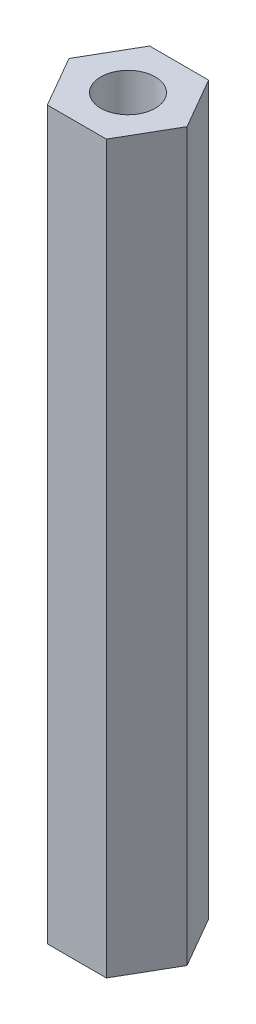
ISO-10303-21;
HEADER;
FILE_DESCRIPTION(('STEP AP214'),'2;1');
FILE_NAME('part.step','',(''),(''),'','','');
FILE_SCHEMA(('AUTOMOTIVE_DESIGN { 1 0 10303 214 1 1 1 1 }'));
ENDSEC;
DATA;
#1=APPLICATION_CONTEXT('core data for automotive mechanical design processes');
#2=APPLICATION_PROTOCOL_DEFINITION('international standard','automotive_design',2000,#1);
#3=PRODUCT_CONTEXT('',#1,'mechanical');
#4=PRODUCT('Part','Part','',(#3));
#5=PRODUCT_RELATED_PRODUCT_CATEGORY('part','',(#4));
#6=PRODUCT_DEFINITION_FORMATION('','',#4);
#7=PRODUCT_DEFINITION_CONTEXT('part definition',#1,'design');
#8=PRODUCT_DEFINITION('design','',#6,#7);
#9=PRODUCT_DEFINITION_SHAPE('','',#8);
#10=(LENGTH_UNIT() NAMED_UNIT(*) SI_UNIT(.MILLI.,.METRE.));
#11=(NAMED_UNIT(*) PLANE_ANGLE_UNIT() SI_UNIT($,.RADIAN.));
#12=(NAMED_UNIT(*) SI_UNIT($,.STERADIAN.) SOLID_ANGLE_UNIT());
#13=UNCERTAINTY_MEASURE_WITH_UNIT(LENGTH_MEASURE(1.E-05),#10,'distance_accuracy_value','');
#14=(GEOMETRIC_REPRESENTATION_CONTEXT(3) GLOBAL_UNCERTAINTY_ASSIGNED_CONTEXT((#13)) GLOBAL_UNIT_ASSIGNED_CONTEXT((#10,
#11,#12)) REPRESENTATION_CONTEXT('',''));
#15=CARTESIAN_POINT('',(0.,0.,0.));
#16=DIRECTION('',(0.,0.,1.));
#17=DIRECTION('',(1.,0.,0.));
#18=AXIS2_PLACEMENT_3D('',#15,#16,#17);
#19=CARTESIAN_POINT('',(0.,40.,0.));
#20=DIRECTION('',(0.,1.,0.));
#21=DIRECTION('',(0.,0.,1.));
#22=AXIS2_PLACEMENT_3D('',#19,#20,#21);
#23=PLANE('',#22);
#24=DIRECTION('',(-1.,0.,0.));
#25=VECTOR('',#24,1.);
#26=CARTESIAN_POINT('',(1.62499999999999,40.,-2.81458256229941));
#27=LINE('',#26,#25);
#28=CARTESIAN_POINT('',(1.62499999999999,40.,-2.81458256229941));
#29=VERTEX_POINT('',#28);
#30=CARTESIAN_POINT('',(-1.62499999999999,40.,-2.81458256229941));
#31=VERTEX_POINT('',#30);
#32=EDGE_CURVE('E135',#29,#31,#27,.T.);
#33=ORIENTED_EDGE('',*,*,#32,.T.);
#34=DIRECTION('',(-0.5,0.,0.866025403784439));
#35=VECTOR('',#34,1.);
#36=CARTESIAN_POINT('',(-1.62499999999999,40.,-2.81458256229941));
#37=LINE('',#36,#35);
#38=CARTESIAN_POINT('',(-3.24999999999998,40.,0.));
#39=VERTEX_POINT('',#38);
#40=EDGE_CURVE('E93',#31,#39,#37,.T.);
#41=ORIENTED_EDGE('',*,*,#40,.T.);
#42=DIRECTION('',(0.5,0.,0.866025403784439));
#43=VECTOR('',#42,1.);
#44=CARTESIAN_POINT('',(-3.24999999999998,40.,0.));
#45=LINE('',#44,#43);
#46=CARTESIAN_POINT('',(-1.62499999999999,40.,2.81458256229941));
#47=VERTEX_POINT('',#46);
#48=EDGE_CURVE('E106',#39,#47,#45,.T.);
#49=ORIENTED_EDGE('',*,*,#48,.T.);
#50=DIRECTION('',(1.,0.,0.));
#51=VECTOR('',#50,1.);
#52=CARTESIAN_POINT('',(-1.62499999999999,40.,2.81458256229941));
#53=LINE('',#52,#51);
#54=CARTESIAN_POINT('',(1.62499999999999,40.,2.81458256229941));
#55=VERTEX_POINT('',#54);
#56=EDGE_CURVE('E100',#47,#55,#53,.T.);
#57=ORIENTED_EDGE('',*,*,#56,.T.);
#58=DIRECTION('',(0.5,0.,-0.866025403784438));
#59=VECTOR('',#58,1.);
#60=CARTESIAN_POINT('',(1.62499999999999,40.,2.81458256229941));
#61=LINE('',#60,#59);
#62=CARTESIAN_POINT('',(3.24999999999999,40.,0.));
#63=VERTEX_POINT('',#62);
#64=EDGE_CURVE('E104',#55,#63,#61,.T.);
#65=ORIENTED_EDGE('',*,*,#64,.T.);
#66=DIRECTION('',(-0.5,0.,-0.866025403784439));
#67=VECTOR('',#66,1.);
#68=CARTESIAN_POINT('',(3.24999999999999,40.,0.));
#69=LINE('',#68,#67);
#70=EDGE_CURVE('E56',#63,#29,#69,.T.);
#71=ORIENTED_EDGE('',*,*,#70,.T.);
#72=EDGE_LOOP('',(#33,#41,#49,#57,#65,#71));
#73=FACE_BOUND('',#72,.T.);
#74=CARTESIAN_POINT('',(0.,40.,0.));
#75=DIRECTION('',(0.,1.,0.));
#76=DIRECTION('',(0.,0.,1.));
#77=AXIS2_PLACEMENT_3D('',#74,#75,#76);
#78=CIRCLE('',#77,1.5);
#79=CARTESIAN_POINT('',(0.,40.,1.5));
#80=VERTEX_POINT('',#79);
#81=EDGE_CURVE('E128',#80,#80,#78,.T.);
#82=ORIENTED_EDGE('',*,*,#81,.F.);
#83=EDGE_LOOP('',(#82));
#84=FACE_BOUND('',#83,.T.);
#85=ADVANCED_FACE('F39',(#73,#84),#23,.T.);
#86=CARTESIAN_POINT('',(0.,0.,0.));
#87=DIRECTION('',(0.,1.,0.));
#88=DIRECTION('',(0.,0.,1.));
#89=AXIS2_PLACEMENT_3D('',#86,#87,#88);
#90=PLANE('',#89);
#91=DIRECTION('',(-1.,0.,0.));
#92=VECTOR('',#91,1.);
#93=CARTESIAN_POINT('',(1.62499999999999,0.,-2.81458256229941));
#94=LINE('',#93,#92);
#95=CARTESIAN_POINT('',(1.62499999999999,0.,-2.81458256229941));
#96=VERTEX_POINT('',#95);
#97=CARTESIAN_POINT('',(-1.62499999999999,0.,-2.81458256229941));
#98=VERTEX_POINT('',#97);
#99=EDGE_CURVE('E124',#96,#98,#94,.T.);
#100=ORIENTED_EDGE('',*,*,#99,.F.);
#101=DIRECTION('',(-0.5,0.,-0.866025403784439));
#102=VECTOR('',#101,1.);
#103=CARTESIAN_POINT('',(3.24999999999999,0.,0.));
#104=LINE('',#103,#102);
#105=CARTESIAN_POINT('',(3.24999999999999,0.,0.));
#106=VERTEX_POINT('',#105);
#107=EDGE_CURVE('E85',#106,#96,#104,.T.);
#108=ORIENTED_EDGE('',*,*,#107,.F.);
#109=DIRECTION('',(0.5,0.,-0.866025403784438));
#110=VECTOR('',#109,1.);
#111=CARTESIAN_POINT('',(1.62499999999999,0.,2.81458256229941));
#112=LINE('',#111,#110);
#113=CARTESIAN_POINT('',(1.62499999999999,0.,2.81458256229941));
#114=VERTEX_POINT('',#113);
#115=EDGE_CURVE('E79',#114,#106,#112,.T.);
#116=ORIENTED_EDGE('',*,*,#115,.F.);
#117=DIRECTION('',(1.,0.,0.));
#118=VECTOR('',#117,1.);
#119=CARTESIAN_POINT('',(-1.62499999999999,0.,2.81458256229941));
#120=LINE('',#119,#118);
#121=CARTESIAN_POINT('',(-1.62499999999999,0.,2.81458256229941));
#122=VERTEX_POINT('',#121);
#123=EDGE_CURVE('E114',#122,#114,#120,.T.);
#124=ORIENTED_EDGE('',*,*,#123,.F.);
#125=DIRECTION('',(0.5,0.,0.866025403784439));
#126=VECTOR('',#125,1.);
#127=CARTESIAN_POINT('',(-3.24999999999998,0.,0.));
#128=LINE('',#127,#126);
#129=CARTESIAN_POINT('',(-3.24999999999998,0.,0.));
#130=VERTEX_POINT('',#129);
#131=EDGE_CURVE('E130',#130,#122,#128,.T.);
#132=ORIENTED_EDGE('',*,*,#131,.F.);
#133=DIRECTION('',(-0.5,0.,0.866025403784439));
#134=VECTOR('',#133,1.);
#135=CARTESIAN_POINT('',(-1.62499999999999,0.,-2.81458256229941));
#136=LINE('',#135,#134);
#137=EDGE_CURVE('E127',#98,#130,#136,.T.);
#138=ORIENTED_EDGE('',*,*,#137,.F.);
#139=EDGE_LOOP('',(#100,#108,#116,#124,#132,#138));
#140=FACE_BOUND('',#139,.T.);
#141=CARTESIAN_POINT('',(0.,0.,0.));
#142=DIRECTION('',(0.,1.,0.));
#143=DIRECTION('',(0.,0.,1.));
#144=AXIS2_PLACEMENT_3D('',#141,#142,#143);
#145=CIRCLE('',#144,1.5);
#146=CARTESIAN_POINT('',(0.,0.,1.5));
#147=VERTEX_POINT('',#146);
#148=EDGE_CURVE('E228',#147,#147,#145,.T.);
#149=ORIENTED_EDGE('',*,*,#148,.T.);
#150=EDGE_LOOP('',(#149));
#151=FACE_BOUND('',#150,.T.);
#152=ADVANCED_FACE('F144',(#140,#151),#90,.F.);
#153=CARTESIAN_POINT('',(1.62499999999999,40.,-2.81458256229941));
#154=DIRECTION('',(0.,0.,1.));
#155=DIRECTION('',(1.,0.,0.));
#156=AXIS2_PLACEMENT_3D('',#153,#154,#155);
#157=PLANE('',#156);
#158=ORIENTED_EDGE('',*,*,#99,.T.);
#159=DIRECTION('',(0.,-1.,0.));
#160=VECTOR('',#159,1.);
#161=CARTESIAN_POINT('',(-1.62499999999999,40.,-2.81458256229941));
#162=LINE('',#161,#160);
#163=EDGE_CURVE('E11',#31,#98,#162,.T.);
#164=ORIENTED_EDGE('',*,*,#163,.F.);
#165=ORIENTED_EDGE('',*,*,#32,.F.);
#166=DIRECTION('',(0.,-1.,0.));
#167=VECTOR('',#166,1.);
#168=CARTESIAN_POINT('',(1.62499999999999,40.,-2.81458256229941));
#169=LINE('',#168,#167);
#170=EDGE_CURVE('E120',#29,#96,#169,.T.);
#171=ORIENTED_EDGE('',*,*,#170,.T.);
#172=EDGE_LOOP('',(#158,#164,#165,#171));
#173=FACE_BOUND('',#172,.T.);
#174=ADVANCED_FACE('F41',(#173),#157,.F.);
#175=CARTESIAN_POINT('',(-1.62499999999999,40.,-2.81458256229941));
#176=DIRECTION('',(0.866025403784439,0.,0.5));
#177=DIRECTION('',(0.5,0.,-0.866025403784439));
#178=AXIS2_PLACEMENT_3D('',#175,#176,#177);
#179=PLANE('',#178);
#180=ORIENTED_EDGE('',*,*,#137,.T.);
#181=DIRECTION('',(0.,-1.,0.));
#182=VECTOR('',#181,1.);
#183=CARTESIAN_POINT('',(-3.24999999999998,40.,0.));
#184=LINE('',#183,#182);
#185=EDGE_CURVE('E48',#39,#130,#184,.T.);
#186=ORIENTED_EDGE('',*,*,#185,.F.);
#187=ORIENTED_EDGE('',*,*,#40,.F.);
#188=ORIENTED_EDGE('',*,*,#163,.T.);
#189=EDGE_LOOP('',(#180,#186,#187,#188));
#190=FACE_BOUND('',#189,.T.);
#191=ADVANCED_FACE('F169',(#190),#179,.F.);
#192=CARTESIAN_POINT('',(-3.24999999999998,40.,0.));
#193=DIRECTION('',(0.866025403784439,0.,-0.5));
#194=DIRECTION('',(-0.5,0.,-0.866025403784439));
#195=AXIS2_PLACEMENT_3D('',#192,#193,#194);
#196=PLANE('',#195);
#197=ORIENTED_EDGE('',*,*,#131,.T.);
#198=DIRECTION('',(0.,-1.,0.));
#199=VECTOR('',#198,1.);
#200=CARTESIAN_POINT('',(-1.62499999999999,40.,2.81458256229941));
#201=LINE('',#200,#199);
#202=EDGE_CURVE('E115',#47,#122,#201,.T.);
#203=ORIENTED_EDGE('',*,*,#202,.F.);
#204=ORIENTED_EDGE('',*,*,#48,.F.);
#205=ORIENTED_EDGE('',*,*,#185,.T.);
#206=EDGE_LOOP('',(#197,#203,#204,#205));
#207=FACE_BOUND('',#206,.T.);
#208=ADVANCED_FACE('F141',(#207),#196,.F.);
#209=CARTESIAN_POINT('',(-1.62499999999999,40.,2.81458256229941));
#210=DIRECTION('',(0.,0.,-1.));
#211=DIRECTION('',(-1.,0.,0.));
#212=AXIS2_PLACEMENT_3D('',#209,#210,#211);
#213=PLANE('',#212);
#214=ORIENTED_EDGE('',*,*,#123,.T.);
#215=DIRECTION('',(0.,-1.,0.));
#216=VECTOR('',#215,1.);
#217=CARTESIAN_POINT('',(1.62499999999999,40.,2.81458256229941));
#218=LINE('',#217,#216);
#219=EDGE_CURVE('E111',#55,#114,#218,.T.);
#220=ORIENTED_EDGE('',*,*,#219,.F.);
#221=ORIENTED_EDGE('',*,*,#56,.F.);
#222=ORIENTED_EDGE('',*,*,#202,.T.);
#223=EDGE_LOOP('',(#214,#220,#221,#222));
#224=FACE_BOUND('',#223,.T.);
#225=ADVANCED_FACE('F112',(#224),#213,.F.);
#226=CARTESIAN_POINT('',(1.62499999999999,40.,2.81458256229941));
#227=DIRECTION('',(-0.866025403784438,0.,-0.5));
#228=DIRECTION('',(-0.5,0.,0.866025403784439));
#229=AXIS2_PLACEMENT_3D('',#226,#227,#228);
#230=PLANE('',#229);
#231=ORIENTED_EDGE('',*,*,#115,.T.);
#232=DIRECTION('',(0.,-1.,0.));
#233=VECTOR('',#232,1.);
#234=CARTESIAN_POINT('',(3.24999999999999,40.,0.));
#235=LINE('',#234,#233);
#236=EDGE_CURVE('E116',#63,#106,#235,.T.);
#237=ORIENTED_EDGE('',*,*,#236,.F.);
#238=ORIENTED_EDGE('',*,*,#64,.F.);
#239=ORIENTED_EDGE('',*,*,#219,.T.);
#240=EDGE_LOOP('',(#231,#237,#238,#239));
#241=FACE_BOUND('',#240,.T.);
#242=ADVANCED_FACE('F118',(#241),#230,.F.);
#243=CARTESIAN_POINT('',(3.24999999999999,40.,0.));
#244=DIRECTION('',(-0.866025403784439,0.,0.5));
#245=DIRECTION('',(0.5,0.,0.866025403784439));
#246=AXIS2_PLACEMENT_3D('',#243,#244,#245);
#247=PLANE('',#246);
#248=ORIENTED_EDGE('',*,*,#107,.T.);
#249=ORIENTED_EDGE('',*,*,#170,.F.);
#250=ORIENTED_EDGE('',*,*,#70,.F.);
#251=ORIENTED_EDGE('',*,*,#236,.T.);
#252=EDGE_LOOP('',(#248,#249,#250,#251));
#253=FACE_BOUND('',#252,.T.);
#254=ADVANCED_FACE('F149',(#253),#247,.F.);
#255=CARTESIAN_POINT('',(0.,40.,0.));
#256=DIRECTION('',(0.,-1.,0.));
#257=DIRECTION('',(0.,0.,-1.));
#258=AXIS2_PLACEMENT_3D('',#255,#256,#257);
#259=CYLINDRICAL_SURFACE('',#258,1.5);
#260=ORIENTED_EDGE('',*,*,#81,.T.);
#261=EDGE_LOOP('',(#260));
#262=FACE_BOUND('',#261,.T.);
#263=ORIENTED_EDGE('',*,*,#148,.F.);
#264=EDGE_LOOP('',(#263));
#265=FACE_BOUND('',#264,.T.);
#266=ADVANCED_FACE('F151',(#262,#265),#259,.F.);
#267=CLOSED_SHELL('',(#85,#152,#174,#191,#208,#225,#242,#254,#266));
#268=MANIFOLD_SOLID_BREP('B2',#267);
#269=ADVANCED_BREP_SHAPE_REPRESENTATION('',(#18,#268),#14);
#270=SHAPE_DEFINITION_REPRESENTATION(#9,#269);
ENDSEC;
END-ISO-10303-21;
